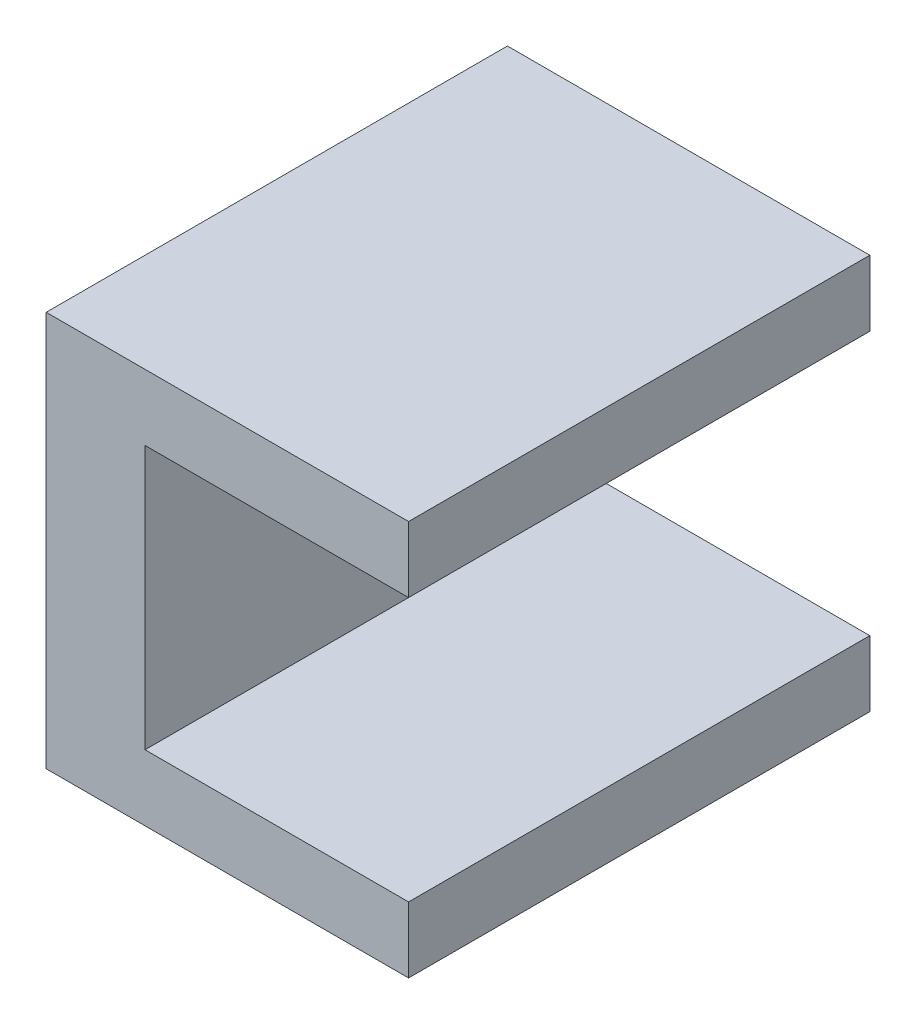
ISO-10303-21;
HEADER;
FILE_DESCRIPTION(('STEP AP214'),'2;1');
FILE_NAME('part.step','',(''),(''),'','','');
FILE_SCHEMA(('AUTOMOTIVE_DESIGN { 1 0 10303 214 1 1 1 1 }'));
ENDSEC;
DATA;
#1=APPLICATION_CONTEXT('core data for automotive mechanical design processes');
#2=APPLICATION_PROTOCOL_DEFINITION('international standard','automotive_design',2000,#1);
#3=PRODUCT_CONTEXT('',#1,'mechanical');
#4=PRODUCT('Part','Part','',(#3));
#5=PRODUCT_RELATED_PRODUCT_CATEGORY('part','',(#4));
#6=PRODUCT_DEFINITION_FORMATION('','',#4);
#7=PRODUCT_DEFINITION_CONTEXT('part definition',#1,'design');
#8=PRODUCT_DEFINITION('design','',#6,#7);
#9=PRODUCT_DEFINITION_SHAPE('','',#8);
#10=(LENGTH_UNIT() NAMED_UNIT(*) SI_UNIT(.MILLI.,.METRE.));
#11=(NAMED_UNIT(*) PLANE_ANGLE_UNIT() SI_UNIT($,.RADIAN.));
#12=(NAMED_UNIT(*) SI_UNIT($,.STERADIAN.) SOLID_ANGLE_UNIT());
#13=UNCERTAINTY_MEASURE_WITH_UNIT(LENGTH_MEASURE(1.E-05),#10,'distance_accuracy_value','');
#14=(GEOMETRIC_REPRESENTATION_CONTEXT(3) GLOBAL_UNCERTAINTY_ASSIGNED_CONTEXT((#13)) GLOBAL_UNIT_ASSIGNED_CONTEXT((#10,
#11,#12)) REPRESENTATION_CONTEXT('',''));
#15=CARTESIAN_POINT('',(0.,0.,0.));
#16=DIRECTION('',(0.,0.,1.));
#17=DIRECTION('',(1.,0.,0.));
#18=AXIS2_PLACEMENT_3D('',#15,#16,#17);
#19=CARTESIAN_POINT('',(2.38125000000001,3.175,11.1125));
#20=DIRECTION('',(-1.,0.,0.));
#21=DIRECTION('',(0.,0.,1.));
#22=AXIS2_PLACEMENT_3D('',#19,#20,#21);
#23=PLANE('',#22);
#24=CARTESIAN_POINT('',(2.38125000000001,11.1125,-3.175));
#25=DIRECTION('',(-1.,0.,0.));
#26=DIRECTION('',(0.,0.,1.));
#27=AXIS2_PLACEMENT_3D('',#24,#25,#26);
#28=CIRCLE('',#27,1.);
#29=CARTESIAN_POINT('',(2.38125000000001,11.1125,-2.175));
#30=VERTEX_POINT('',#29);
#31=EDGE_CURVE('E142',#30,#30,#28,.T.);
#32=ORIENTED_EDGE('',*,*,#31,.T.);
#33=EDGE_LOOP('',(#32));
#34=FACE_BOUND('',#33,.T.);
#35=CARTESIAN_POINT('',(2.38125000000001,11.1125,3.175));
#36=DIRECTION('',(-1.,0.,0.));
#37=DIRECTION('',(0.,0.,1.));
#38=AXIS2_PLACEMENT_3D('',#35,#36,#37);
#39=CIRCLE('',#38,1.);
#40=CARTESIAN_POINT('',(2.38125000000001,11.1125,4.175));
#41=VERTEX_POINT('',#40);
#42=EDGE_CURVE('E141',#41,#41,#39,.T.);
#43=ORIENTED_EDGE('',*,*,#42,.T.);
#44=EDGE_LOOP('',(#43));
#45=FACE_BOUND('',#44,.T.);
#46=DIRECTION('',(0.,0.,1.));
#47=VECTOR('',#46,1.);
#48=CARTESIAN_POINT('',(2.38125000000001,3.175,-11.1125));
#49=LINE('',#48,#47);
#50=CARTESIAN_POINT('',(2.38125000000001,3.175,-11.1125));
#51=VERTEX_POINT('',#50);
#52=CARTESIAN_POINT('',(2.38125000000001,3.175,11.1125));
#53=VERTEX_POINT('',#52);
#54=EDGE_CURVE('E49',#51,#53,#49,.T.);
#55=ORIENTED_EDGE('',*,*,#54,.F.);
#56=DIRECTION('',(0.,-1.,0.));
#57=VECTOR('',#56,1.);
#58=CARTESIAN_POINT('',(2.38125000000001,3.175,-11.1125));
#59=LINE('',#58,#57);
#60=CARTESIAN_POINT('',(2.38125000000001,15.875,-11.1125));
#61=VERTEX_POINT('',#60);
#62=EDGE_CURVE('E11',#61,#51,#59,.T.);
#63=ORIENTED_EDGE('',*,*,#62,.F.);
#64=DIRECTION('',(0.,0.,-1.));
#65=VECTOR('',#64,1.);
#66=CARTESIAN_POINT('',(2.38125000000001,15.875,11.1125));
#67=LINE('',#66,#65);
#68=CARTESIAN_POINT('',(2.38125000000001,15.875,11.1125));
#69=VERTEX_POINT('',#68);
#70=EDGE_CURVE('E118',#69,#61,#67,.T.);
#71=ORIENTED_EDGE('',*,*,#70,.F.);
#72=DIRECTION('',(0.,-1.,0.));
#73=VECTOR('',#72,1.);
#74=CARTESIAN_POINT('',(2.38125000000001,3.175,11.1125));
#75=LINE('',#74,#73);
#76=EDGE_CURVE('E53',#69,#53,#75,.T.);
#77=ORIENTED_EDGE('',*,*,#76,.T.);
#78=EDGE_LOOP('',(#55,#63,#71,#77));
#79=FACE_BOUND('',#78,.T.);
#80=ADVANCED_FACE('F35',(#34,#45,#79),#23,.F.);
#81=CARTESIAN_POINT('',(-2.38124999999999,3.175,-11.1125));
#82=DIRECTION('',(0.,0.,1.));
#83=DIRECTION('',(1.,0.,0.));
#84=AXIS2_PLACEMENT_3D('',#81,#82,#83);
#85=PLANE('',#84);
#86=DIRECTION('',(-1.,0.,0.));
#87=VECTOR('',#86,1.);
#88=CARTESIAN_POINT('',(-2.38124999999999,0.,-11.1125));
#89=LINE('',#88,#87);
#90=CARTESIAN_POINT('',(15.08125,0.,-11.1125));
#91=VERTEX_POINT('',#90);
#92=CARTESIAN_POINT('',(-2.38124999999999,0.,-11.1125));
#93=VERTEX_POINT('',#92);
#94=EDGE_CURVE('E161',#91,#93,#89,.T.);
#95=ORIENTED_EDGE('',*,*,#94,.T.);
#96=DIRECTION('',(0.,-1.,0.));
#97=VECTOR('',#96,1.);
#98=CARTESIAN_POINT('',(-2.38124999999999,3.175,-11.1125));
#99=LINE('',#98,#97);
#100=CARTESIAN_POINT('',(-2.38124999999999,19.05,-11.1125));
#101=VERTEX_POINT('',#100);
#102=EDGE_CURVE('E42',#101,#93,#99,.T.);
#103=ORIENTED_EDGE('',*,*,#102,.F.);
#104=DIRECTION('',(-1.,0.,0.));
#105=VECTOR('',#104,1.);
#106=CARTESIAN_POINT('',(0.,19.05,-11.1125));
#107=LINE('',#106,#105);
#108=CARTESIAN_POINT('',(15.08125,19.05,-11.1125));
#109=VERTEX_POINT('',#108);
#110=EDGE_CURVE('E155',#109,#101,#107,.T.);
#111=ORIENTED_EDGE('',*,*,#110,.F.);
#112=DIRECTION('',(0.,1.,0.));
#113=VECTOR('',#112,1.);
#114=CARTESIAN_POINT('',(15.08125,19.05,-11.1125));
#115=LINE('',#114,#113);
#116=CARTESIAN_POINT('',(15.08125,15.875,-11.1125));
#117=VERTEX_POINT('',#116);
#118=EDGE_CURVE('E130',#117,#109,#115,.T.);
#119=ORIENTED_EDGE('',*,*,#118,.F.);
#120=DIRECTION('',(-1.,0.,0.));
#121=VECTOR('',#120,1.);
#122=CARTESIAN_POINT('',(15.08125,15.875,-11.1125));
#123=LINE('',#122,#121);
#124=EDGE_CURVE('E135',#117,#61,#123,.T.);
#125=ORIENTED_EDGE('',*,*,#124,.T.);
#126=ORIENTED_EDGE('',*,*,#62,.T.);
#127=DIRECTION('',(-1.,0.,0.));
#128=VECTOR('',#127,1.);
#129=CARTESIAN_POINT('',(15.08125,3.175,-11.1125));
#130=LINE('',#129,#128);
#131=CARTESIAN_POINT('',(15.08125,3.175,-11.1125));
#132=VERTEX_POINT('',#131);
#133=EDGE_CURVE('E100',#132,#51,#130,.T.);
#134=ORIENTED_EDGE('',*,*,#133,.F.);
#135=DIRECTION('',(0.,1.,0.));
#136=VECTOR('',#135,1.);
#137=CARTESIAN_POINT('',(15.08125,0.,-11.1125));
#138=LINE('',#137,#136);
#139=EDGE_CURVE('E107',#91,#132,#138,.T.);
#140=ORIENTED_EDGE('',*,*,#139,.F.);
#141=EDGE_LOOP('',(#95,#103,#111,#119,#125,#126,#134,#140));
#142=FACE_BOUND('',#141,.T.);
#143=ADVANCED_FACE('F116',(#142),#85,.F.);
#144=CARTESIAN_POINT('',(-2.38124999999999,3.175,11.1125));
#145=DIRECTION('',(1.,0.,0.));
#146=DIRECTION('',(0.,0.,-1.));
#147=AXIS2_PLACEMENT_3D('',#144,#145,#146);
#148=PLANE('',#147);
#149=CARTESIAN_POINT('',(-2.38124999999999,11.1125,-3.175));
#150=DIRECTION('',(-1.,0.,0.));
#151=DIRECTION('',(0.,0.,1.));
#152=AXIS2_PLACEMENT_3D('',#149,#150,#151);
#153=CIRCLE('',#152,1.);
#154=CARTESIAN_POINT('',(-2.38124999999999,11.1125,-2.175));
#155=VERTEX_POINT('',#154);
#156=EDGE_CURVE('E146',#155,#155,#153,.T.);
#157=ORIENTED_EDGE('',*,*,#156,.F.);
#158=EDGE_LOOP('',(#157));
#159=FACE_BOUND('',#158,.T.);
#160=CARTESIAN_POINT('',(-2.38124999999999,11.1125,3.175));
#161=DIRECTION('',(-1.,0.,0.));
#162=DIRECTION('',(0.,0.,1.));
#163=AXIS2_PLACEMENT_3D('',#160,#161,#162);
#164=CIRCLE('',#163,1.);
#165=CARTESIAN_POINT('',(-2.38124999999999,11.1125,4.175));
#166=VERTEX_POINT('',#165);
#167=EDGE_CURVE('E149',#166,#166,#164,.T.);
#168=ORIENTED_EDGE('',*,*,#167,.F.);
#169=EDGE_LOOP('',(#168));
#170=FACE_BOUND('',#169,.T.);
#171=DIRECTION('',(0.,0.,1.));
#172=VECTOR('',#171,1.);
#173=CARTESIAN_POINT('',(-2.38124999999999,0.,11.1125));
#174=LINE('',#173,#172);
#175=CARTESIAN_POINT('',(-2.38124999999999,0.,11.1125));
#176=VERTEX_POINT('',#175);
#177=EDGE_CURVE('E163',#93,#176,#174,.T.);
#178=ORIENTED_EDGE('',*,*,#177,.T.);
#179=DIRECTION('',(0.,-1.,0.));
#180=VECTOR('',#179,1.);
#181=CARTESIAN_POINT('',(-2.38124999999999,3.175,11.1125));
#182=LINE('',#181,#180);
#183=CARTESIAN_POINT('',(-2.38124999999999,19.05,11.1125));
#184=VERTEX_POINT('',#183);
#185=EDGE_CURVE('E168',#184,#176,#182,.T.);
#186=ORIENTED_EDGE('',*,*,#185,.F.);
#187=DIRECTION('',(0.,0.,1.));
#188=VECTOR('',#187,1.);
#189=CARTESIAN_POINT('',(-2.38124999999999,19.05,0.));
#190=LINE('',#189,#188);
#191=EDGE_CURVE('E158',#101,#184,#190,.T.);
#192=ORIENTED_EDGE('',*,*,#191,.F.);
#193=ORIENTED_EDGE('',*,*,#102,.T.);
#194=EDGE_LOOP('',(#178,#186,#192,#193));
#195=FACE_BOUND('',#194,.T.);
#196=ADVANCED_FACE('F174',(#159,#170,#195),#148,.F.);
#197=CARTESIAN_POINT('',(-2.38124999999999,3.175,11.1125));
#198=DIRECTION('',(0.,0.,-1.));
#199=DIRECTION('',(-1.,0.,0.));
#200=AXIS2_PLACEMENT_3D('',#197,#198,#199);
#201=PLANE('',#200);
#202=DIRECTION('',(1.,0.,0.));
#203=VECTOR('',#202,1.);
#204=CARTESIAN_POINT('',(-2.38124999999999,0.,11.1125));
#205=LINE('',#204,#203);
#206=CARTESIAN_POINT('',(15.08125,0.,11.1125));
#207=VERTEX_POINT('',#206);
#208=EDGE_CURVE('E165',#176,#207,#205,.T.);
#209=ORIENTED_EDGE('',*,*,#208,.T.);
#210=DIRECTION('',(0.,-1.,0.));
#211=VECTOR('',#210,1.);
#212=CARTESIAN_POINT('',(15.08125,0.,11.1125));
#213=LINE('',#212,#211);
#214=CARTESIAN_POINT('',(15.08125,3.175,11.1125));
#215=VERTEX_POINT('',#214);
#216=EDGE_CURVE('E106',#215,#207,#213,.T.);
#217=ORIENTED_EDGE('',*,*,#216,.F.);
#218=DIRECTION('',(-1.,0.,0.));
#219=VECTOR('',#218,1.);
#220=CARTESIAN_POINT('',(15.08125,3.175,11.1125));
#221=LINE('',#220,#219);
#222=EDGE_CURVE('E102',#215,#53,#221,.T.);
#223=ORIENTED_EDGE('',*,*,#222,.T.);
#224=ORIENTED_EDGE('',*,*,#76,.F.);
#225=DIRECTION('',(-1.,0.,0.));
#226=VECTOR('',#225,1.);
#227=CARTESIAN_POINT('',(15.08125,15.875,11.1125));
#228=LINE('',#227,#226);
#229=CARTESIAN_POINT('',(15.08125,15.875,11.1125));
#230=VERTEX_POINT('',#229);
#231=EDGE_CURVE('E138',#230,#69,#228,.T.);
#232=ORIENTED_EDGE('',*,*,#231,.F.);
#233=DIRECTION('',(0.,-1.,0.));
#234=VECTOR('',#233,1.);
#235=CARTESIAN_POINT('',(15.08125,19.05,11.1125));
#236=LINE('',#235,#234);
#237=CARTESIAN_POINT('',(15.08125,19.05,11.1125));
#238=VERTEX_POINT('',#237);
#239=EDGE_CURVE('E121',#238,#230,#236,.T.);
#240=ORIENTED_EDGE('',*,*,#239,.F.);
#241=DIRECTION('',(1.,0.,0.));
#242=VECTOR('',#241,1.);
#243=CARTESIAN_POINT('',(0.,19.05,11.1125));
#244=LINE('',#243,#242);
#245=EDGE_CURVE('E145',#184,#238,#244,.T.);
#246=ORIENTED_EDGE('',*,*,#245,.F.);
#247=ORIENTED_EDGE('',*,*,#185,.T.);
#248=EDGE_LOOP('',(#209,#217,#223,#224,#232,#240,#246,#247));
#249=FACE_BOUND('',#248,.T.);
#250=ADVANCED_FACE('F179',(#249),#201,.F.);
#251=CARTESIAN_POINT('',(0.,0.,0.));
#252=DIRECTION('',(0.,-1.,0.));
#253=DIRECTION('',(0.,0.,-1.));
#254=AXIS2_PLACEMENT_3D('',#251,#252,#253);
#255=PLANE('',#254);
#256=ORIENTED_EDGE('',*,*,#94,.F.);
#257=DIRECTION('',(0.,0.,-1.));
#258=VECTOR('',#257,1.);
#259=CARTESIAN_POINT('',(15.08125,0.,-11.1125));
#260=LINE('',#259,#258);
#261=EDGE_CURVE('E113',#207,#91,#260,.T.);
#262=ORIENTED_EDGE('',*,*,#261,.F.);
#263=ORIENTED_EDGE('',*,*,#208,.F.);
#264=ORIENTED_EDGE('',*,*,#177,.F.);
#265=EDGE_LOOP('',(#256,#262,#263,#264));
#266=FACE_BOUND('',#265,.T.);
#267=ADVANCED_FACE('F177',(#266),#255,.T.);
#268=CARTESIAN_POINT('',(0.,19.05,0.));
#269=DIRECTION('',(0.,1.,0.));
#270=DIRECTION('',(0.,0.,1.));
#271=AXIS2_PLACEMENT_3D('',#268,#269,#270);
#272=PLANE('',#271);
#273=ORIENTED_EDGE('',*,*,#245,.T.);
#274=DIRECTION('',(0.,0.,1.));
#275=VECTOR('',#274,1.);
#276=CARTESIAN_POINT('',(15.08125,19.05,11.1125));
#277=LINE('',#276,#275);
#278=EDGE_CURVE('E133',#109,#238,#277,.T.);
#279=ORIENTED_EDGE('',*,*,#278,.F.);
#280=ORIENTED_EDGE('',*,*,#110,.T.);
#281=ORIENTED_EDGE('',*,*,#191,.T.);
#282=EDGE_LOOP('',(#273,#279,#280,#281));
#283=FACE_BOUND('',#282,.T.);
#284=ADVANCED_FACE('F193',(#283),#272,.T.);
#285=CARTESIAN_POINT('',(2.38125000000001,11.1125,3.175));
#286=DIRECTION('',(-1.,0.,0.));
#287=DIRECTION('',(0.,0.,1.));
#288=AXIS2_PLACEMENT_3D('',#285,#286,#287);
#289=CYLINDRICAL_SURFACE('',#288,1.);
#290=ORIENTED_EDGE('',*,*,#42,.F.);
#291=EDGE_LOOP('',(#290));
#292=FACE_BOUND('',#291,.T.);
#293=ORIENTED_EDGE('',*,*,#167,.T.);
#294=EDGE_LOOP('',(#293));
#295=FACE_BOUND('',#294,.T.);
#296=ADVANCED_FACE('F195',(#292,#295),#289,.F.);
#297=CARTESIAN_POINT('',(2.38125000000001,11.1125,-3.175));
#298=DIRECTION('',(-1.,0.,0.));
#299=DIRECTION('',(0.,0.,1.));
#300=AXIS2_PLACEMENT_3D('',#297,#298,#299);
#301=CYLINDRICAL_SURFACE('',#300,1.);
#302=ORIENTED_EDGE('',*,*,#31,.F.);
#303=EDGE_LOOP('',(#302));
#304=FACE_BOUND('',#303,.T.);
#305=ORIENTED_EDGE('',*,*,#156,.T.);
#306=EDGE_LOOP('',(#305));
#307=FACE_BOUND('',#306,.T.);
#308=ADVANCED_FACE('F202',(#304,#307),#301,.F.);
#309=CARTESIAN_POINT('',(15.08125,15.875,11.1125));
#310=DIRECTION('',(0.,1.,0.));
#311=DIRECTION('',(0.,0.,1.));
#312=AXIS2_PLACEMENT_3D('',#309,#310,#311);
#313=PLANE('',#312);
#314=ORIENTED_EDGE('',*,*,#70,.T.);
#315=ORIENTED_EDGE('',*,*,#124,.F.);
#316=DIRECTION('',(0.,0.,-1.));
#317=VECTOR('',#316,1.);
#318=CARTESIAN_POINT('',(15.08125,15.875,11.1125));
#319=LINE('',#318,#317);
#320=EDGE_CURVE('E128',#230,#117,#319,.T.);
#321=ORIENTED_EDGE('',*,*,#320,.F.);
#322=ORIENTED_EDGE('',*,*,#231,.T.);
#323=EDGE_LOOP('',(#314,#315,#321,#322));
#324=FACE_BOUND('',#323,.T.);
#325=ADVANCED_FACE('F186',(#324),#313,.F.);
#326=CARTESIAN_POINT('',(15.08125,0.,0.));
#327=DIRECTION('',(1.,0.,0.));
#328=DIRECTION('',(0.,0.,-1.));
#329=AXIS2_PLACEMENT_3D('',#326,#327,#328);
#330=PLANE('',#329);
#331=ORIENTED_EDGE('',*,*,#239,.T.);
#332=ORIENTED_EDGE('',*,*,#320,.T.);
#333=ORIENTED_EDGE('',*,*,#118,.T.);
#334=ORIENTED_EDGE('',*,*,#278,.T.);
#335=EDGE_LOOP('',(#331,#332,#333,#334));
#336=FACE_BOUND('',#335,.T.);
#337=ADVANCED_FACE('F190',(#336),#330,.T.);
#338=CARTESIAN_POINT('',(15.08125,3.175,-11.1125));
#339=DIRECTION('',(0.,-1.,0.));
#340=DIRECTION('',(0.,0.,-1.));
#341=AXIS2_PLACEMENT_3D('',#338,#339,#340);
#342=PLANE('',#341);
#343=ORIENTED_EDGE('',*,*,#54,.T.);
#344=ORIENTED_EDGE('',*,*,#222,.F.);
#345=DIRECTION('',(0.,0.,1.));
#346=VECTOR('',#345,1.);
#347=CARTESIAN_POINT('',(15.08125,3.175,-11.1125));
#348=LINE('',#347,#346);
#349=EDGE_CURVE('E96',#132,#215,#348,.T.);
#350=ORIENTED_EDGE('',*,*,#349,.F.);
#351=ORIENTED_EDGE('',*,*,#133,.T.);
#352=EDGE_LOOP('',(#343,#344,#350,#351));
#353=FACE_BOUND('',#352,.T.);
#354=ADVANCED_FACE('F98',(#353),#342,.F.);
#355=CARTESIAN_POINT('',(15.08125,0.,0.));
#356=DIRECTION('',(1.,0.,0.));
#357=DIRECTION('',(0.,0.,-1.));
#358=AXIS2_PLACEMENT_3D('',#355,#356,#357);
#359=PLANE('',#358);
#360=ORIENTED_EDGE('',*,*,#139,.T.);
#361=ORIENTED_EDGE('',*,*,#349,.T.);
#362=ORIENTED_EDGE('',*,*,#216,.T.);
#363=ORIENTED_EDGE('',*,*,#261,.T.);
#364=EDGE_LOOP('',(#360,#361,#362,#363));
#365=FACE_BOUND('',#364,.T.);
#366=ADVANCED_FACE('F111',(#365),#359,.T.);
#367=CLOSED_SHELL('',(#80,#143,#196,#250,#267,#284,#296,#308,#325,#337,#354,#366));
#368=MANIFOLD_SOLID_BREP('B2',#367);
#369=ADVANCED_BREP_SHAPE_REPRESENTATION('',(#18,#368),#14);
#370=SHAPE_DEFINITION_REPRESENTATION(#9,#369);
ENDSEC;
END-ISO-10303-21;
